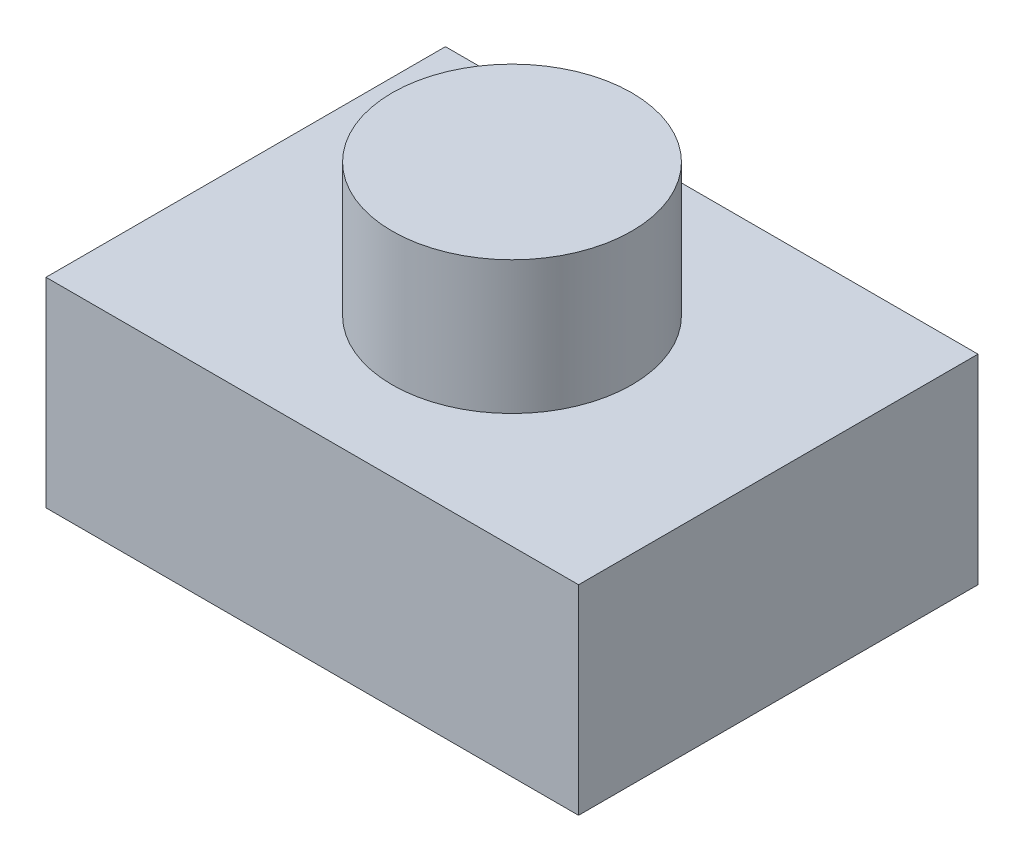
ISO-10303-21;
HEADER;
FILE_DESCRIPTION(('STEP AP214'),'2;1');
FILE_NAME('part.step','',(''),(''),'','','');
FILE_SCHEMA(('AUTOMOTIVE_DESIGN { 1 0 10303 214 1 1 1 1 }'));
ENDSEC;
DATA;
#1=APPLICATION_CONTEXT('core data for automotive mechanical design processes');
#2=APPLICATION_PROTOCOL_DEFINITION('international standard','automotive_design',2000,#1);
#3=PRODUCT_CONTEXT('',#1,'mechanical');
#4=PRODUCT('Part','Part','',(#3));
#5=PRODUCT_RELATED_PRODUCT_CATEGORY('part','',(#4));
#6=PRODUCT_DEFINITION_FORMATION('','',#4);
#7=PRODUCT_DEFINITION_CONTEXT('part definition',#1,'design');
#8=PRODUCT_DEFINITION('design','',#6,#7);
#9=PRODUCT_DEFINITION_SHAPE('','',#8);
#10=(LENGTH_UNIT() NAMED_UNIT(*) SI_UNIT(.MILLI.,.METRE.));
#11=(NAMED_UNIT(*) PLANE_ANGLE_UNIT() SI_UNIT($,.RADIAN.));
#12=(NAMED_UNIT(*) SI_UNIT($,.STERADIAN.) SOLID_ANGLE_UNIT());
#13=UNCERTAINTY_MEASURE_WITH_UNIT(LENGTH_MEASURE(1.E-05),#10,'distance_accuracy_value','');
#14=(GEOMETRIC_REPRESENTATION_CONTEXT(3) GLOBAL_UNCERTAINTY_ASSIGNED_CONTEXT((#13)) GLOBAL_UNIT_ASSIGNED_CONTEXT((#10,
#11,#12)) REPRESENTATION_CONTEXT('',''));
#15=CARTESIAN_POINT('',(0.,0.,0.));
#16=DIRECTION('',(0.,0.,1.));
#17=DIRECTION('',(1.,0.,0.));
#18=AXIS2_PLACEMENT_3D('',#15,#16,#17);
#19=CARTESIAN_POINT('',(-2.,1.5,-1.5));
#20=DIRECTION('',(1.,0.,0.));
#21=DIRECTION('',(0.,0.,-1.));
#22=AXIS2_PLACEMENT_3D('',#19,#20,#21);
#23=PLANE('',#22);
#24=DIRECTION('',(0.,0.,1.));
#25=VECTOR('',#24,1.);
#26=CARTESIAN_POINT('',(-2.,0.,-1.5));
#27=LINE('',#26,#25);
#28=CARTESIAN_POINT('',(-2.,0.,-1.5));
#29=VERTEX_POINT('',#28);
#30=CARTESIAN_POINT('',(-2.,0.,1.5));
#31=VERTEX_POINT('',#30);
#32=EDGE_CURVE('E98',#29,#31,#27,.T.);
#33=ORIENTED_EDGE('',*,*,#32,.T.);
#34=DIRECTION('',(0.,-1.,0.));
#35=VECTOR('',#34,1.);
#36=CARTESIAN_POINT('',(-2.,1.5,1.5));
#37=LINE('',#36,#35);
#38=CARTESIAN_POINT('',(-2.,1.5,1.5));
#39=VERTEX_POINT('',#38);
#40=EDGE_CURVE('E35',#39,#31,#37,.T.);
#41=ORIENTED_EDGE('',*,*,#40,.F.);
#42=DIRECTION('',(0.,0.,1.));
#43=VECTOR('',#42,1.);
#44=CARTESIAN_POINT('',(-2.,1.5,-1.5));
#45=LINE('',#44,#43);
#46=CARTESIAN_POINT('',(-2.,1.5,-1.5));
#47=VERTEX_POINT('',#46);
#48=EDGE_CURVE('E85',#47,#39,#45,.T.);
#49=ORIENTED_EDGE('',*,*,#48,.F.);
#50=DIRECTION('',(0.,-1.,0.));
#51=VECTOR('',#50,1.);
#52=CARTESIAN_POINT('',(-2.,1.5,-1.5));
#53=LINE('',#52,#51);
#54=EDGE_CURVE('E94',#47,#29,#53,.T.);
#55=ORIENTED_EDGE('',*,*,#54,.T.);
#56=EDGE_LOOP('',(#33,#41,#49,#55));
#57=FACE_BOUND('',#56,.T.);
#58=ADVANCED_FACE('F32',(#57),#23,.F.);
#59=CARTESIAN_POINT('',(-2.,1.5,1.5));
#60=DIRECTION('',(0.,0.,-1.));
#61=DIRECTION('',(-1.,0.,0.));
#62=AXIS2_PLACEMENT_3D('',#59,#60,#61);
#63=PLANE('',#62);
#64=DIRECTION('',(1.,0.,0.));
#65=VECTOR('',#64,1.);
#66=CARTESIAN_POINT('',(-2.,0.,1.5));
#67=LINE('',#66,#65);
#68=CARTESIAN_POINT('',(2.,0.,1.5));
#69=VERTEX_POINT('',#68);
#70=EDGE_CURVE('E90',#31,#69,#67,.T.);
#71=ORIENTED_EDGE('',*,*,#70,.T.);
#72=DIRECTION('',(0.,-1.,0.));
#73=VECTOR('',#72,1.);
#74=CARTESIAN_POINT('',(2.,1.5,1.5));
#75=LINE('',#74,#73);
#76=CARTESIAN_POINT('',(2.,1.5,1.5));
#77=VERTEX_POINT('',#76);
#78=EDGE_CURVE('E88',#77,#69,#75,.T.);
#79=ORIENTED_EDGE('',*,*,#78,.F.);
#80=DIRECTION('',(1.,0.,0.));
#81=VECTOR('',#80,1.);
#82=CARTESIAN_POINT('',(-2.,1.5,1.5));
#83=LINE('',#82,#81);
#84=EDGE_CURVE('E80',#39,#77,#83,.T.);
#85=ORIENTED_EDGE('',*,*,#84,.F.);
#86=ORIENTED_EDGE('',*,*,#40,.T.);
#87=EDGE_LOOP('',(#71,#79,#85,#86));
#88=FACE_BOUND('',#87,.T.);
#89=ADVANCED_FACE('F89',(#88),#63,.F.);
#90=CARTESIAN_POINT('',(2.,1.5,-1.5));
#91=DIRECTION('',(-1.,0.,0.));
#92=DIRECTION('',(0.,0.,1.));
#93=AXIS2_PLACEMENT_3D('',#90,#91,#92);
#94=PLANE('',#93);
#95=DIRECTION('',(0.,0.,-1.));
#96=VECTOR('',#95,1.);
#97=CARTESIAN_POINT('',(2.,0.,-1.5));
#98=LINE('',#97,#96);
#99=CARTESIAN_POINT('',(2.,0.,-1.5));
#100=VERTEX_POINT('',#99);
#101=EDGE_CURVE('E66',#69,#100,#98,.T.);
#102=ORIENTED_EDGE('',*,*,#101,.T.);
#103=DIRECTION('',(0.,-1.,0.));
#104=VECTOR('',#103,1.);
#105=CARTESIAN_POINT('',(2.,1.5,-1.5));
#106=LINE('',#105,#104);
#107=CARTESIAN_POINT('',(2.,1.5,-1.5));
#108=VERTEX_POINT('',#107);
#109=EDGE_CURVE('E91',#108,#100,#106,.T.);
#110=ORIENTED_EDGE('',*,*,#109,.F.);
#111=DIRECTION('',(0.,0.,-1.));
#112=VECTOR('',#111,1.);
#113=CARTESIAN_POINT('',(2.,1.5,-1.5));
#114=LINE('',#113,#112);
#115=EDGE_CURVE('E83',#77,#108,#114,.T.);
#116=ORIENTED_EDGE('',*,*,#115,.F.);
#117=ORIENTED_EDGE('',*,*,#78,.T.);
#118=EDGE_LOOP('',(#102,#110,#116,#117));
#119=FACE_BOUND('',#118,.T.);
#120=ADVANCED_FACE('F92',(#119),#94,.F.);
#121=CARTESIAN_POINT('',(-2.,1.5,-1.5));
#122=DIRECTION('',(0.,0.,1.));
#123=DIRECTION('',(1.,0.,0.));
#124=AXIS2_PLACEMENT_3D('',#121,#122,#123);
#125=PLANE('',#124);
#126=DIRECTION('',(-1.,0.,0.));
#127=VECTOR('',#126,1.);
#128=CARTESIAN_POINT('',(-2.,0.,-1.5));
#129=LINE('',#128,#127);
#130=EDGE_CURVE('E72',#100,#29,#129,.T.);
#131=ORIENTED_EDGE('',*,*,#130,.T.);
#132=ORIENTED_EDGE('',*,*,#54,.F.);
#133=DIRECTION('',(-1.,0.,0.));
#134=VECTOR('',#133,1.);
#135=CARTESIAN_POINT('',(-2.,1.5,-1.5));
#136=LINE('',#135,#134);
#137=EDGE_CURVE('E49',#108,#47,#136,.T.);
#138=ORIENTED_EDGE('',*,*,#137,.F.);
#139=ORIENTED_EDGE('',*,*,#109,.T.);
#140=EDGE_LOOP('',(#131,#132,#138,#139));
#141=FACE_BOUND('',#140,.T.);
#142=ADVANCED_FACE('F106',(#141),#125,.F.);
#143=CARTESIAN_POINT('',(0.,1.5,0.));
#144=DIRECTION('',(0.,1.,0.));
#145=DIRECTION('',(0.,0.,1.));
#146=AXIS2_PLACEMENT_3D('',#143,#144,#145);
#147=PLANE('',#146);
#148=CARTESIAN_POINT('',(0.,1.5,0.));
#149=DIRECTION('',(0.,1.,0.));
#150=DIRECTION('',(0.,0.,1.));
#151=AXIS2_PLACEMENT_3D('',#148,#149,#150);
#152=CIRCLE('',#151,0.9);
#153=CARTESIAN_POINT('',(0.,1.5,0.9));
#154=VERTEX_POINT('',#153);
#155=EDGE_CURVE('E11',#154,#154,#152,.T.);
#156=ORIENTED_EDGE('',*,*,#155,.F.);
#157=EDGE_LOOP('',(#156));
#158=FACE_BOUND('',#157,.T.);
#159=ORIENTED_EDGE('',*,*,#48,.T.);
#160=ORIENTED_EDGE('',*,*,#84,.T.);
#161=ORIENTED_EDGE('',*,*,#115,.T.);
#162=ORIENTED_EDGE('',*,*,#137,.T.);
#163=EDGE_LOOP('',(#159,#160,#161,#162));
#164=FACE_BOUND('',#163,.T.);
#165=ADVANCED_FACE('F81',(#158,#164),#147,.T.);
#166=CARTESIAN_POINT('',(0.,0.,0.));
#167=DIRECTION('',(0.,1.,0.));
#168=DIRECTION('',(0.,0.,1.));
#169=AXIS2_PLACEMENT_3D('',#166,#167,#168);
#170=PLANE('',#169);
#171=ORIENTED_EDGE('',*,*,#32,.F.);
#172=ORIENTED_EDGE('',*,*,#130,.F.);
#173=ORIENTED_EDGE('',*,*,#101,.F.);
#174=ORIENTED_EDGE('',*,*,#70,.F.);
#175=EDGE_LOOP('',(#171,#172,#173,#174));
#176=FACE_BOUND('',#175,.T.);
#177=ADVANCED_FACE('F109',(#176),#170,.F.);
#178=CARTESIAN_POINT('',(0.,2.5,0.));
#179=DIRECTION('',(0.,-1.,0.));
#180=DIRECTION('',(0.,0.,-1.));
#181=AXIS2_PLACEMENT_3D('',#178,#179,#180);
#182=CYLINDRICAL_SURFACE('',#181,0.9);
#183=CARTESIAN_POINT('',(0.,2.5,0.));
#184=DIRECTION('',(0.,1.,0.));
#185=DIRECTION('',(0.,0.,1.));
#186=AXIS2_PLACEMENT_3D('',#183,#184,#185);
#187=CIRCLE('',#186,0.9);
#188=CARTESIAN_POINT('',(0.,2.5,0.9));
#189=VERTEX_POINT('',#188);
#190=EDGE_CURVE('E101',#189,#189,#187,.T.);
#191=ORIENTED_EDGE('',*,*,#190,.F.);
#192=EDGE_LOOP('',(#191));
#193=FACE_BOUND('',#192,.T.);
#194=ORIENTED_EDGE('',*,*,#155,.T.);
#195=EDGE_LOOP('',(#194));
#196=FACE_BOUND('',#195,.T.);
#197=ADVANCED_FACE('F117',(#193,#196),#182,.T.);
#198=CARTESIAN_POINT('',(0.,2.5,0.));
#199=DIRECTION('',(0.,1.,0.));
#200=DIRECTION('',(0.,0.,1.));
#201=AXIS2_PLACEMENT_3D('',#198,#199,#200);
#202=PLANE('',#201);
#203=ORIENTED_EDGE('',*,*,#190,.T.);
#204=EDGE_LOOP('',(#203));
#205=FACE_BOUND('',#204,.T.);
#206=ADVANCED_FACE('F115',(#205),#202,.T.);
#207=CLOSED_SHELL('',(#58,#89,#120,#142,#165,#177,#197,#206));
#208=MANIFOLD_SOLID_BREP('B2',#207);
#209=ADVANCED_BREP_SHAPE_REPRESENTATION('',(#18,#208),#14);
#210=SHAPE_DEFINITION_REPRESENTATION(#9,#209);
ENDSEC;
END-ISO-10303-21;
